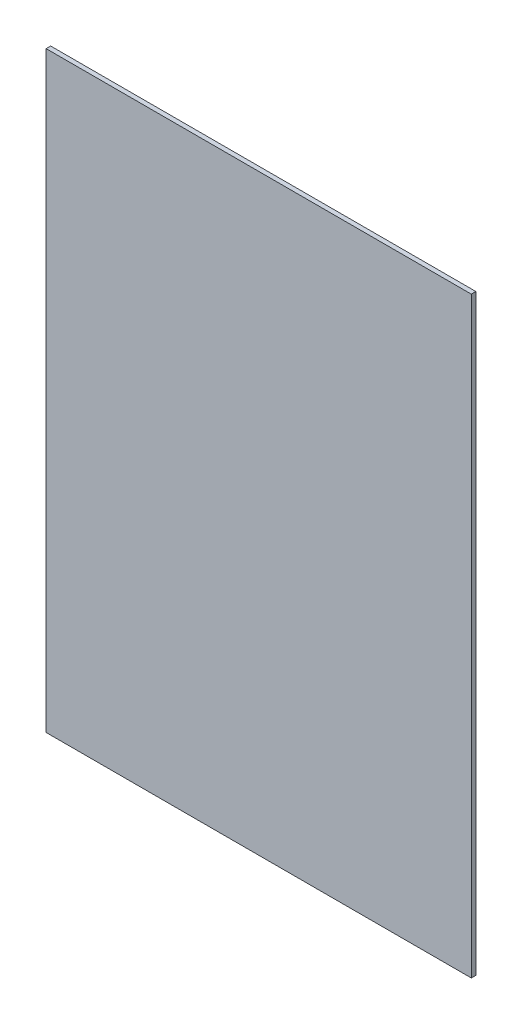
ISO-10303-21;
HEADER;
FILE_DESCRIPTION(('STEP AP214'),'2;1');
FILE_NAME('part.step','',(''),(''),'','','');
FILE_SCHEMA(('AUTOMOTIVE_DESIGN { 1 0 10303 214 1 1 1 1 }'));
ENDSEC;
DATA;
#1=APPLICATION_CONTEXT('core data for automotive mechanical design processes');
#2=APPLICATION_PROTOCOL_DEFINITION('international standard','automotive_design',2000,#1);
#3=PRODUCT_CONTEXT('',#1,'mechanical');
#4=PRODUCT('Part','Part','',(#3));
#5=PRODUCT_RELATED_PRODUCT_CATEGORY('part','',(#4));
#6=PRODUCT_DEFINITION_FORMATION('','',#4);
#7=PRODUCT_DEFINITION_CONTEXT('part definition',#1,'design');
#8=PRODUCT_DEFINITION('design','',#6,#7);
#9=PRODUCT_DEFINITION_SHAPE('','',#8);
#10=(LENGTH_UNIT() NAMED_UNIT(*) SI_UNIT(.MILLI.,.METRE.));
#11=(NAMED_UNIT(*) PLANE_ANGLE_UNIT() SI_UNIT($,.RADIAN.));
#12=(NAMED_UNIT(*) SI_UNIT($,.STERADIAN.) SOLID_ANGLE_UNIT());
#13=UNCERTAINTY_MEASURE_WITH_UNIT(LENGTH_MEASURE(1.E-05),#10,'distance_accuracy_value','');
#14=(GEOMETRIC_REPRESENTATION_CONTEXT(3) GLOBAL_UNCERTAINTY_ASSIGNED_CONTEXT((#13)) GLOBAL_UNIT_ASSIGNED_CONTEXT((#10,
#11,#12)) REPRESENTATION_CONTEXT('',''));
#15=CARTESIAN_POINT('',(0.,0.,0.));
#16=DIRECTION('',(0.,0.,1.));
#17=DIRECTION('',(1.,0.,0.));
#18=AXIS2_PLACEMENT_3D('',#15,#16,#17);
#19=CARTESIAN_POINT('',(0.,0.,0.3));
#20=DIRECTION('',(1.,0.,0.));
#21=DIRECTION('',(0.,1.,0.));
#22=AXIS2_PLACEMENT_3D('',#19,#20,#21);
#23=PLANE('',#22);
#24=DIRECTION('',(0.,-1.,0.));
#25=VECTOR('',#24,1.);
#26=CARTESIAN_POINT('',(0.,0.,0.));
#27=LINE('',#26,#25);
#28=CARTESIAN_POINT('',(0.,39.,0.));
#29=VERTEX_POINT('',#28);
#30=CARTESIAN_POINT('',(0.,0.,0.));
#31=VERTEX_POINT('',#30);
#32=EDGE_CURVE('E98',#29,#31,#27,.T.);
#33=ORIENTED_EDGE('',*,*,#32,.T.);
#34=DIRECTION('',(0.,0.,-1.));
#35=VECTOR('',#34,1.);
#36=CARTESIAN_POINT('',(0.,0.,0.3));
#37=LINE('',#36,#35);
#38=CARTESIAN_POINT('',(0.,0.,0.3));
#39=VERTEX_POINT('',#38);
#40=EDGE_CURVE('E11',#39,#31,#37,.T.);
#41=ORIENTED_EDGE('',*,*,#40,.F.);
#42=DIRECTION('',(0.,-1.,0.));
#43=VECTOR('',#42,1.);
#44=CARTESIAN_POINT('',(0.,0.,0.3));
#45=LINE('',#44,#43);
#46=CARTESIAN_POINT('',(0.,39.,0.3));
#47=VERTEX_POINT('',#46);
#48=EDGE_CURVE('E86',#47,#39,#45,.T.);
#49=ORIENTED_EDGE('',*,*,#48,.F.);
#50=DIRECTION('',(0.,0.,-1.));
#51=VECTOR('',#50,1.);
#52=CARTESIAN_POINT('',(0.,39.,0.3));
#53=LINE('',#52,#51);
#54=EDGE_CURVE('E94',#47,#29,#53,.T.);
#55=ORIENTED_EDGE('',*,*,#54,.T.);
#56=EDGE_LOOP('',(#33,#41,#49,#55));
#57=FACE_BOUND('',#56,.T.);
#58=ADVANCED_FACE('F35',(#57),#23,.F.);
#59=CARTESIAN_POINT('',(0.,0.,0.3));
#60=DIRECTION('',(0.,1.,0.));
#61=DIRECTION('',(0.,0.,1.));
#62=AXIS2_PLACEMENT_3D('',#59,#60,#61);
#63=PLANE('',#62);
#64=DIRECTION('',(1.,0.,0.));
#65=VECTOR('',#64,1.);
#66=CARTESIAN_POINT('',(0.,0.,0.));
#67=LINE('',#66,#65);
#68=CARTESIAN_POINT('',(28.,0.,0.));
#69=VERTEX_POINT('',#68);
#70=EDGE_CURVE('E90',#31,#69,#67,.T.);
#71=ORIENTED_EDGE('',*,*,#70,.T.);
#72=DIRECTION('',(0.,0.,-1.));
#73=VECTOR('',#72,1.);
#74=CARTESIAN_POINT('',(28.,0.,0.3));
#75=LINE('',#74,#73);
#76=CARTESIAN_POINT('',(28.,0.,0.3));
#77=VERTEX_POINT('',#76);
#78=EDGE_CURVE('E43',#77,#69,#75,.T.);
#79=ORIENTED_EDGE('',*,*,#78,.F.);
#80=DIRECTION('',(1.,0.,0.));
#81=VECTOR('',#80,1.);
#82=CARTESIAN_POINT('',(0.,0.,0.3));
#83=LINE('',#82,#81);
#84=EDGE_CURVE('E81',#39,#77,#83,.T.);
#85=ORIENTED_EDGE('',*,*,#84,.F.);
#86=ORIENTED_EDGE('',*,*,#40,.T.);
#87=EDGE_LOOP('',(#71,#79,#85,#86));
#88=FACE_BOUND('',#87,.T.);
#89=ADVANCED_FACE('F89',(#88),#63,.F.);
#90=CARTESIAN_POINT('',(28.,0.,0.3));
#91=DIRECTION('',(-1.,0.,0.));
#92=DIRECTION('',(0.,-1.,0.));
#93=AXIS2_PLACEMENT_3D('',#90,#91,#92);
#94=PLANE('',#93);
#95=DIRECTION('',(0.,1.,0.));
#96=VECTOR('',#95,1.);
#97=CARTESIAN_POINT('',(28.,0.,0.));
#98=LINE('',#97,#96);
#99=CARTESIAN_POINT('',(28.,39.,0.));
#100=VERTEX_POINT('',#99);
#101=EDGE_CURVE('E68',#69,#100,#98,.T.);
#102=ORIENTED_EDGE('',*,*,#101,.T.);
#103=DIRECTION('',(0.,0.,-1.));
#104=VECTOR('',#103,1.);
#105=CARTESIAN_POINT('',(28.,39.,0.3));
#106=LINE('',#105,#104);
#107=CARTESIAN_POINT('',(28.,39.,0.3));
#108=VERTEX_POINT('',#107);
#109=EDGE_CURVE('E91',#108,#100,#106,.T.);
#110=ORIENTED_EDGE('',*,*,#109,.F.);
#111=DIRECTION('',(0.,1.,0.));
#112=VECTOR('',#111,1.);
#113=CARTESIAN_POINT('',(28.,0.,0.3));
#114=LINE('',#113,#112);
#115=EDGE_CURVE('E84',#77,#108,#114,.T.);
#116=ORIENTED_EDGE('',*,*,#115,.F.);
#117=ORIENTED_EDGE('',*,*,#78,.T.);
#118=EDGE_LOOP('',(#102,#110,#116,#117));
#119=FACE_BOUND('',#118,.T.);
#120=ADVANCED_FACE('F92',(#119),#94,.F.);
#121=CARTESIAN_POINT('',(0.,39.,0.3));
#122=DIRECTION('',(0.,-1.,0.));
#123=DIRECTION('',(0.,0.,-1.));
#124=AXIS2_PLACEMENT_3D('',#121,#122,#123);
#125=PLANE('',#124);
#126=DIRECTION('',(-1.,0.,0.));
#127=VECTOR('',#126,1.);
#128=CARTESIAN_POINT('',(0.,39.,0.));
#129=LINE('',#128,#127);
#130=EDGE_CURVE('E74',#100,#29,#129,.T.);
#131=ORIENTED_EDGE('',*,*,#130,.T.);
#132=ORIENTED_EDGE('',*,*,#54,.F.);
#133=DIRECTION('',(-1.,0.,0.));
#134=VECTOR('',#133,1.);
#135=CARTESIAN_POINT('',(0.,39.,0.3));
#136=LINE('',#135,#134);
#137=EDGE_CURVE('E51',#108,#47,#136,.T.);
#138=ORIENTED_EDGE('',*,*,#137,.F.);
#139=ORIENTED_EDGE('',*,*,#109,.T.);
#140=EDGE_LOOP('',(#131,#132,#138,#139));
#141=FACE_BOUND('',#140,.T.);
#142=ADVANCED_FACE('F105',(#141),#125,.F.);
#143=CARTESIAN_POINT('',(0.,0.,0.3));
#144=DIRECTION('',(0.,0.,-1.));
#145=DIRECTION('',(-1.,0.,0.));
#146=AXIS2_PLACEMENT_3D('',#143,#144,#145);
#147=PLANE('',#146);
#148=ORIENTED_EDGE('',*,*,#48,.T.);
#149=ORIENTED_EDGE('',*,*,#84,.T.);
#150=ORIENTED_EDGE('',*,*,#115,.T.);
#151=ORIENTED_EDGE('',*,*,#137,.T.);
#152=EDGE_LOOP('',(#148,#149,#150,#151));
#153=FACE_BOUND('',#152,.T.);
#154=ADVANCED_FACE('F82',(#153),#147,.F.);
#155=CARTESIAN_POINT('',(0.,0.,0.));
#156=DIRECTION('',(0.,0.,-1.));
#157=DIRECTION('',(-1.,0.,0.));
#158=AXIS2_PLACEMENT_3D('',#155,#156,#157);
#159=PLANE('',#158);
#160=ORIENTED_EDGE('',*,*,#32,.F.);
#161=ORIENTED_EDGE('',*,*,#130,.F.);
#162=ORIENTED_EDGE('',*,*,#101,.F.);
#163=ORIENTED_EDGE('',*,*,#70,.F.);
#164=EDGE_LOOP('',(#160,#161,#162,#163));
#165=FACE_BOUND('',#164,.T.);
#166=ADVANCED_FACE('F108',(#165),#159,.T.);
#167=CLOSED_SHELL('',(#58,#89,#120,#142,#154,#166));
#168=MANIFOLD_SOLID_BREP('B2',#167);
#169=ADVANCED_BREP_SHAPE_REPRESENTATION('',(#18,#168),#14);
#170=SHAPE_DEFINITION_REPRESENTATION(#9,#169);
ENDSEC;
END-ISO-10303-21;
